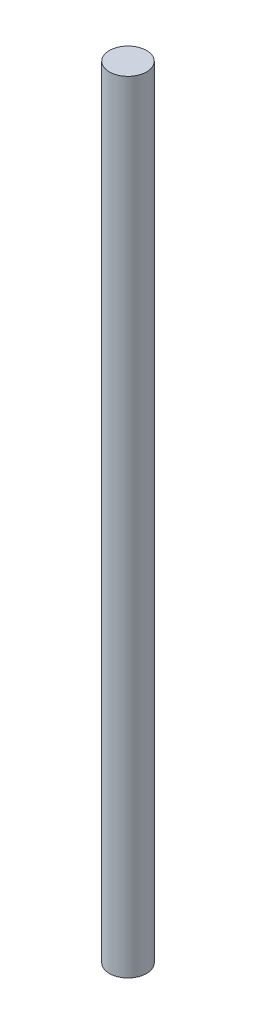
ISO-10303-21;
HEADER;
FILE_DESCRIPTION(('STEP AP214'),'2;1');
FILE_NAME('part.step','',(''),(''),'','','');
FILE_SCHEMA(('AUTOMOTIVE_DESIGN { 1 0 10303 214 1 1 1 1 }'));
ENDSEC;
DATA;
#1=APPLICATION_CONTEXT('core data for automotive mechanical design processes');
#2=APPLICATION_PROTOCOL_DEFINITION('international standard','automotive_design',2000,#1);
#3=PRODUCT_CONTEXT('',#1,'mechanical');
#4=PRODUCT('Part','Part','',(#3));
#5=PRODUCT_RELATED_PRODUCT_CATEGORY('part','',(#4));
#6=PRODUCT_DEFINITION_FORMATION('','',#4);
#7=PRODUCT_DEFINITION_CONTEXT('part definition',#1,'design');
#8=PRODUCT_DEFINITION('design','',#6,#7);
#9=PRODUCT_DEFINITION_SHAPE('','',#8);
#10=(LENGTH_UNIT() NAMED_UNIT(*) SI_UNIT(.MILLI.,.METRE.));
#11=(NAMED_UNIT(*) PLANE_ANGLE_UNIT() SI_UNIT($,.RADIAN.));
#12=(NAMED_UNIT(*) SI_UNIT($,.STERADIAN.) SOLID_ANGLE_UNIT());
#13=UNCERTAINTY_MEASURE_WITH_UNIT(LENGTH_MEASURE(1.E-05),#10,'distance_accuracy_value','');
#14=(GEOMETRIC_REPRESENTATION_CONTEXT(3) GLOBAL_UNCERTAINTY_ASSIGNED_CONTEXT((#13)) GLOBAL_UNIT_ASSIGNED_CONTEXT((#10,
#11,#12)) REPRESENTATION_CONTEXT('',''));
#15=CARTESIAN_POINT('',(0.,0.,0.));
#16=DIRECTION('',(0.,0.,1.));
#17=DIRECTION('',(1.,0.,0.));
#18=AXIS2_PLACEMENT_3D('',#15,#16,#17);
#19=CARTESIAN_POINT('',(0.,84.,0.));
#20=DIRECTION('',(0.,-1.,0.));
#21=DIRECTION('',(0.,0.,-1.));
#22=AXIS2_PLACEMENT_3D('',#19,#20,#21);
#23=CYLINDRICAL_SURFACE('',#22,2.);
#24=CARTESIAN_POINT('',(0.,84.,0.));
#25=DIRECTION('',(0.,1.,0.));
#26=DIRECTION('',(0.,0.,1.));
#27=AXIS2_PLACEMENT_3D('',#24,#25,#26);
#28=CIRCLE('',#27,2.);
#29=CARTESIAN_POINT('',(0.,84.,2.));
#30=VERTEX_POINT('',#29);
#31=EDGE_CURVE('E10',#30,#30,#28,.T.);
#32=ORIENTED_EDGE('',*,*,#31,.F.);
#33=EDGE_LOOP('',(#32));
#34=FACE_BOUND('',#33,.T.);
#35=CARTESIAN_POINT('',(0.,0.,0.));
#36=DIRECTION('',(0.,1.,0.));
#37=DIRECTION('',(0.,0.,1.));
#38=AXIS2_PLACEMENT_3D('',#35,#36,#37);
#39=CIRCLE('',#38,2.);
#40=CARTESIAN_POINT('',(0.,0.,2.));
#41=VERTEX_POINT('',#40);
#42=EDGE_CURVE('E41',#41,#41,#39,.T.);
#43=ORIENTED_EDGE('',*,*,#42,.T.);
#44=EDGE_LOOP('',(#43));
#45=FACE_BOUND('',#44,.T.);
#46=ADVANCED_FACE('F38',(#34,#45),#23,.T.);
#47=CARTESIAN_POINT('',(0.,84.,0.));
#48=DIRECTION('',(0.,1.,0.));
#49=DIRECTION('',(0.,0.,1.));
#50=AXIS2_PLACEMENT_3D('',#47,#48,#49);
#51=PLANE('',#50);
#52=ORIENTED_EDGE('',*,*,#31,.T.);
#53=EDGE_LOOP('',(#52));
#54=FACE_BOUND('',#53,.T.);
#55=ADVANCED_FACE('F57',(#54),#51,.T.);
#56=CARTESIAN_POINT('',(0.,0.,0.));
#57=DIRECTION('',(0.,1.,0.));
#58=DIRECTION('',(0.,0.,1.));
#59=AXIS2_PLACEMENT_3D('',#56,#57,#58);
#60=PLANE('',#59);
#61=ORIENTED_EDGE('',*,*,#42,.F.);
#62=EDGE_LOOP('',(#61));
#63=FACE_BOUND('',#62,.T.);
#64=ADVANCED_FACE('F55',(#63),#60,.F.);
#65=CLOSED_SHELL('',(#46,#55,#64));
#66=MANIFOLD_SOLID_BREP('B2',#65);
#67=ADVANCED_BREP_SHAPE_REPRESENTATION('',(#18,#66),#14);
#68=SHAPE_DEFINITION_REPRESENTATION(#9,#67);
ENDSEC;
END-ISO-10303-21;
